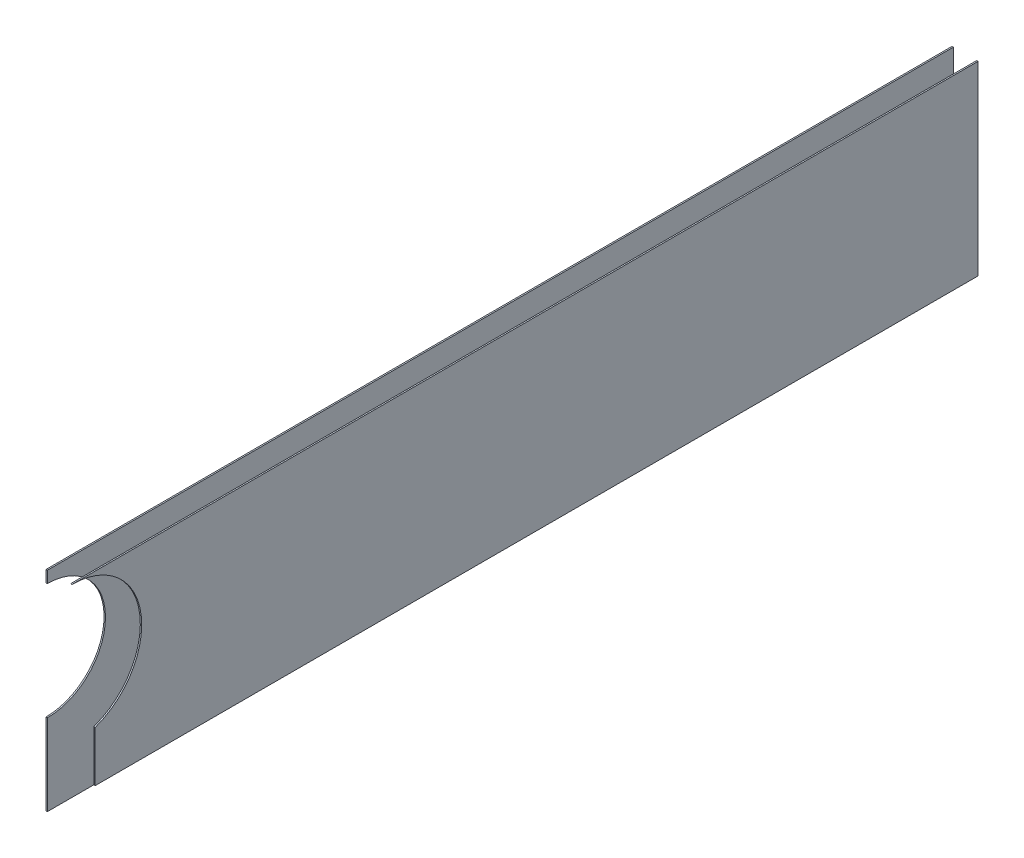
ISO-10303-21;
HEADER;
FILE_DESCRIPTION(('STEP AP214'),'2;1');
FILE_NAME('part.step','',(''),(''),'','','');
FILE_SCHEMA(('AUTOMOTIVE_DESIGN { 1 0 10303 214 1 1 1 1 }'));
ENDSEC;
DATA;
#1=APPLICATION_CONTEXT('core data for automotive mechanical design processes');
#2=APPLICATION_PROTOCOL_DEFINITION('international standard','automotive_design',2000,#1);
#3=PRODUCT_CONTEXT('',#1,'mechanical');
#4=PRODUCT('Part','Part','',(#3));
#5=PRODUCT_RELATED_PRODUCT_CATEGORY('part','',(#4));
#6=PRODUCT_DEFINITION_FORMATION('','',#4);
#7=PRODUCT_DEFINITION_CONTEXT('part definition',#1,'design');
#8=PRODUCT_DEFINITION('design','',#6,#7);
#9=PRODUCT_DEFINITION_SHAPE('','',#8);
#10=(LENGTH_UNIT() NAMED_UNIT(*) SI_UNIT(.MILLI.,.METRE.));
#11=(NAMED_UNIT(*) PLANE_ANGLE_UNIT() SI_UNIT($,.RADIAN.));
#12=(NAMED_UNIT(*) SI_UNIT($,.STERADIAN.) SOLID_ANGLE_UNIT());
#13=UNCERTAINTY_MEASURE_WITH_UNIT(LENGTH_MEASURE(1.E-05),#10,'distance_accuracy_value','');
#14=(GEOMETRIC_REPRESENTATION_CONTEXT(3) GLOBAL_UNCERTAINTY_ASSIGNED_CONTEXT((#13)) GLOBAL_UNIT_ASSIGNED_CONTEXT((#10,
#11,#12)) REPRESENTATION_CONTEXT('',''));
#15=CARTESIAN_POINT('',(0.,0.,0.));
#16=DIRECTION('',(0.,0.,1.));
#17=DIRECTION('',(1.,0.,0.));
#18=AXIS2_PLACEMENT_3D('',#15,#16,#17);
#19=CARTESIAN_POINT('',(-521.502987022629,700.,-237.681641947689));
#20=DIRECTION('',(0.,1.,0.));
#21=DIRECTION('',(0.,0.,-1.));
#22=AXIS2_PLACEMENT_3D('',#19,#20,#21);
#23=PLANE('',#22);
#24=DIRECTION('',(0.,0.,-1.));
#25=VECTOR('',#24,1.);
#26=CARTESIAN_POINT('',(-521.202987022629,700.,-237.681641947689));
#27=LINE('',#26,#25);
#28=CARTESIAN_POINT('',(-521.202987022629,700.,-237.681641947689));
#29=VERTEX_POINT('',#28);
#30=CARTESIAN_POINT('',(-521.202987022629,700.,-432.681641947689));
#31=VERTEX_POINT('',#30);
#32=EDGE_CURVE('E130',#29,#31,#27,.T.);
#33=ORIENTED_EDGE('',*,*,#32,.F.);
#34=DIRECTION('',(1.,0.,0.));
#35=VECTOR('',#34,1.);
#36=CARTESIAN_POINT('',(-521.502987022629,700.,-237.681641947689));
#37=LINE('',#36,#35);
#38=CARTESIAN_POINT('',(-521.502987022629,700.,-237.681641947689));
#39=VERTEX_POINT('',#38);
#40=EDGE_CURVE('E129',#39,#29,#37,.T.);
#41=ORIENTED_EDGE('',*,*,#40,.F.);
#42=DIRECTION('',(0.,0.,-1.));
#43=VECTOR('',#42,1.);
#44=CARTESIAN_POINT('',(-521.502987022629,700.,-237.681641947689));
#45=LINE('',#44,#43);
#46=CARTESIAN_POINT('',(-521.502987022629,700.,-432.681641947689));
#47=VERTEX_POINT('',#46);
#48=EDGE_CURVE('E142',#39,#47,#45,.T.);
#49=ORIENTED_EDGE('',*,*,#48,.T.);
#50=DIRECTION('',(1.,0.,0.));
#51=VECTOR('',#50,1.);
#52=CARTESIAN_POINT('',(-521.502987022629,700.,-432.681641947689));
#53=LINE('',#52,#51);
#54=EDGE_CURVE('E12',#47,#31,#53,.T.);
#55=ORIENTED_EDGE('',*,*,#54,.T.);
#56=EDGE_LOOP('',(#33,#41,#49,#55));
#57=FACE_BOUND('',#56,.T.);
#58=ADVANCED_FACE('F47',(#57),#23,.F.);
#59=CARTESIAN_POINT('',(-521.502987022629,700.,-432.681641947689));
#60=DIRECTION('',(0.,0.,1.));
#61=DIRECTION('',(-1.,0.,0.));
#62=AXIS2_PLACEMENT_3D('',#59,#60,#61);
#63=PLANE('',#62);
#64=DIRECTION('',(0.,1.,0.));
#65=VECTOR('',#64,1.);
#66=CARTESIAN_POINT('',(-521.202987022629,700.,-432.681641947689));
#67=LINE('',#66,#65);
#68=CARTESIAN_POINT('',(-521.202987022629,745.,-432.681641947689));
#69=VERTEX_POINT('',#68);
#70=EDGE_CURVE('E132',#31,#69,#67,.T.);
#71=ORIENTED_EDGE('',*,*,#70,.F.);
#72=ORIENTED_EDGE('',*,*,#54,.F.);
#73=DIRECTION('',(0.,1.,0.));
#74=VECTOR('',#73,1.);
#75=CARTESIAN_POINT('',(-521.502987022629,700.,-432.681641947689));
#76=LINE('',#75,#74);
#77=CARTESIAN_POINT('',(-521.502987022629,745.,-432.681641947689));
#78=VERTEX_POINT('',#77);
#79=EDGE_CURVE('E95',#47,#78,#76,.T.);
#80=ORIENTED_EDGE('',*,*,#79,.T.);
#81=DIRECTION('',(1.,0.,0.));
#82=VECTOR('',#81,1.);
#83=CARTESIAN_POINT('',(-521.502987022629,745.,-432.681641947689));
#84=LINE('',#83,#82);
#85=EDGE_CURVE('E55',#78,#69,#84,.T.);
#86=ORIENTED_EDGE('',*,*,#85,.T.);
#87=EDGE_LOOP('',(#71,#72,#80,#86));
#88=FACE_BOUND('',#87,.T.);
#89=ADVANCED_FACE('F148',(#88),#63,.F.);
#90=CARTESIAN_POINT('',(-521.502987022629,745.,-432.681641947689));
#91=DIRECTION('',(0.,-1.,0.));
#92=DIRECTION('',(0.,0.,1.));
#93=AXIS2_PLACEMENT_3D('',#90,#91,#92);
#94=PLANE('',#93);
#95=DIRECTION('',(0.,0.,1.));
#96=VECTOR('',#95,1.);
#97=CARTESIAN_POINT('',(-521.202987022629,745.,-432.681641947689));
#98=LINE('',#97,#96);
#99=CARTESIAN_POINT('',(-521.202987022629,745.,-237.681641947689));
#100=VERTEX_POINT('',#99);
#101=EDGE_CURVE('E135',#69,#100,#98,.T.);
#102=ORIENTED_EDGE('',*,*,#101,.F.);
#103=ORIENTED_EDGE('',*,*,#85,.F.);
#104=DIRECTION('',(0.,0.,1.));
#105=VECTOR('',#104,1.);
#106=CARTESIAN_POINT('',(-521.502987022629,745.,-432.681641947689));
#107=LINE('',#106,#105);
#108=CARTESIAN_POINT('',(-521.502987022629,745.,-237.681641947689));
#109=VERTEX_POINT('',#108);
#110=EDGE_CURVE('E123',#78,#109,#107,.T.);
#111=ORIENTED_EDGE('',*,*,#110,.T.);
#112=DIRECTION('',(1.,0.,0.));
#113=VECTOR('',#112,1.);
#114=CARTESIAN_POINT('',(-521.502987022629,745.,-237.681641947689));
#115=LINE('',#114,#113);
#116=EDGE_CURVE('E117',#109,#100,#115,.T.);
#117=ORIENTED_EDGE('',*,*,#116,.T.);
#118=EDGE_LOOP('',(#102,#103,#111,#117));
#119=FACE_BOUND('',#118,.T.);
#120=ADVANCED_FACE('F170',(#119),#94,.F.);
#121=CARTESIAN_POINT('',(-521.502987022629,745.,-237.681641947689));
#122=DIRECTION('',(0.,0.,-1.));
#123=DIRECTION('',(1.,0.,0.));
#124=AXIS2_PLACEMENT_3D('',#121,#122,#123);
#125=PLANE('',#124);
#126=DIRECTION('',(0.,-1.,0.));
#127=VECTOR('',#126,1.);
#128=CARTESIAN_POINT('',(-521.202987022629,745.,-237.681641947689));
#129=LINE('',#128,#127);
#130=CARTESIAN_POINT('',(-521.202987022629,742.5,-237.681641947689));
#131=VERTEX_POINT('',#130);
#132=EDGE_CURVE('E138',#100,#131,#129,.T.);
#133=ORIENTED_EDGE('',*,*,#132,.F.);
#134=ORIENTED_EDGE('',*,*,#116,.F.);
#135=DIRECTION('',(0.,-1.,0.));
#136=VECTOR('',#135,1.);
#137=CARTESIAN_POINT('',(-521.502987022629,745.,-237.681641947689));
#138=LINE('',#137,#136);
#139=CARTESIAN_POINT('',(-521.502987022629,742.5,-237.681641947689));
#140=VERTEX_POINT('',#139);
#141=EDGE_CURVE('E107',#109,#140,#138,.T.);
#142=ORIENTED_EDGE('',*,*,#141,.T.);
#143=DIRECTION('',(1.,0.,0.));
#144=VECTOR('',#143,1.);
#145=CARTESIAN_POINT('',(-521.502987022629,742.5,-237.681641947689));
#146=LINE('',#145,#144);
#147=EDGE_CURVE('E112',#140,#131,#146,.T.);
#148=ORIENTED_EDGE('',*,*,#147,.T.);
#149=EDGE_LOOP('',(#133,#134,#142,#148));
#150=FACE_BOUND('',#149,.T.);
#151=ADVANCED_FACE('F120',(#150),#125,.F.);
#152=CARTESIAN_POINT('',(-521.502987022629,730.,-237.681641947689));
#153=DIRECTION('',(1.,0.,0.));
#154=DIRECTION('',(0.,0.,1.));
#155=AXIS2_PLACEMENT_3D('',#152,#153,#154);
#156=CYLINDRICAL_SURFACE('',#155,12.5);
#157=CARTESIAN_POINT('',(-521.202987022629,730.,-237.681641947689));
#158=DIRECTION('',(-1.,0.,0.));
#159=DIRECTION('',(0.,0.,-1.));
#160=AXIS2_PLACEMENT_3D('',#157,#158,#159);
#161=CIRCLE('',#160,12.5);
#162=CARTESIAN_POINT('',(-521.202987022629,717.5,-237.681641947689));
#163=VERTEX_POINT('',#162);
#164=EDGE_CURVE('E114',#131,#163,#161,.T.);
#165=ORIENTED_EDGE('',*,*,#164,.F.);
#166=ORIENTED_EDGE('',*,*,#147,.F.);
#167=CARTESIAN_POINT('',(-521.502987022629,730.,-237.681641947689));
#168=DIRECTION('',(-1.,0.,0.));
#169=DIRECTION('',(0.,0.,-1.));
#170=AXIS2_PLACEMENT_3D('',#167,#168,#169);
#171=CIRCLE('',#170,12.5);
#172=CARTESIAN_POINT('',(-521.502987022629,717.5,-237.681641947689));
#173=VERTEX_POINT('',#172);
#174=EDGE_CURVE('E103',#140,#173,#171,.T.);
#175=ORIENTED_EDGE('',*,*,#174,.T.);
#176=DIRECTION('',(1.,0.,0.));
#177=VECTOR('',#176,1.);
#178=CARTESIAN_POINT('',(-521.502987022629,717.5,-237.681641947689));
#179=LINE('',#178,#177);
#180=EDGE_CURVE('E118',#173,#163,#179,.T.);
#181=ORIENTED_EDGE('',*,*,#180,.T.);
#182=EDGE_LOOP('',(#165,#166,#175,#181));
#183=FACE_BOUND('',#182,.T.);
#184=ADVANCED_FACE('F113',(#183),#156,.F.);
#185=CARTESIAN_POINT('',(-521.502987022629,717.5,-237.681641947689));
#186=DIRECTION('',(0.,0.,-1.));
#187=DIRECTION('',(1.,0.,0.));
#188=AXIS2_PLACEMENT_3D('',#185,#186,#187);
#189=PLANE('',#188);
#190=DIRECTION('',(0.,-1.,0.));
#191=VECTOR('',#190,1.);
#192=CARTESIAN_POINT('',(-521.202987022629,717.5,-237.681641947689));
#193=LINE('',#192,#191);
#194=EDGE_CURVE('E83',#163,#29,#193,.T.);
#195=ORIENTED_EDGE('',*,*,#194,.F.);
#196=ORIENTED_EDGE('',*,*,#180,.F.);
#197=DIRECTION('',(0.,-1.,0.));
#198=VECTOR('',#197,1.);
#199=CARTESIAN_POINT('',(-521.502987022629,717.5,-237.681641947689));
#200=LINE('',#199,#198);
#201=EDGE_CURVE('E63',#173,#39,#200,.T.);
#202=ORIENTED_EDGE('',*,*,#201,.T.);
#203=ORIENTED_EDGE('',*,*,#40,.T.);
#204=EDGE_LOOP('',(#195,#196,#202,#203));
#205=FACE_BOUND('',#204,.T.);
#206=ADVANCED_FACE('F156',(#205),#189,.F.);
#207=CARTESIAN_POINT('',(-521.502987022629,730.,-237.681641947689));
#208=DIRECTION('',(-1.,0.,0.));
#209=DIRECTION('',(0.,0.,-1.));
#210=AXIS2_PLACEMENT_3D('',#207,#208,#209);
#211=PLANE('',#210);
#212=ORIENTED_EDGE('',*,*,#48,.F.);
#213=ORIENTED_EDGE('',*,*,#201,.F.);
#214=ORIENTED_EDGE('',*,*,#174,.F.);
#215=ORIENTED_EDGE('',*,*,#141,.F.);
#216=ORIENTED_EDGE('',*,*,#110,.F.);
#217=ORIENTED_EDGE('',*,*,#79,.F.);
#218=EDGE_LOOP('',(#212,#213,#214,#215,#216,#217));
#219=FACE_BOUND('',#218,.T.);
#220=ADVANCED_FACE('F105',(#219),#211,.T.);
#221=CARTESIAN_POINT('',(-521.202987022629,730.,-237.681641947689));
#222=DIRECTION('',(-1.,0.,0.));
#223=DIRECTION('',(0.,0.,-1.));
#224=AXIS2_PLACEMENT_3D('',#221,#222,#223);
#225=PLANE('',#224);
#226=ORIENTED_EDGE('',*,*,#32,.T.);
#227=ORIENTED_EDGE('',*,*,#70,.T.);
#228=ORIENTED_EDGE('',*,*,#101,.T.);
#229=ORIENTED_EDGE('',*,*,#132,.T.);
#230=ORIENTED_EDGE('',*,*,#164,.T.);
#231=ORIENTED_EDGE('',*,*,#194,.T.);
#232=EDGE_LOOP('',(#226,#227,#228,#229,#230,#231));
#233=FACE_BOUND('',#232,.T.);
#234=ADVANCED_FACE('F150',(#233),#225,.F.);
#235=CLOSED_SHELL('',(#58,#89,#120,#151,#184,#206,#220,#234));
#236=MANIFOLD_SOLID_BREP('B2',#235);
#237=CARTESIAN_POINT('',(-515.90298702263,745.,-432.681641947689));
#238=DIRECTION('',(0.,0.,1.));
#239=DIRECTION('',(-1.,0.,0.));
#240=AXIS2_PLACEMENT_3D('',#237,#238,#239);
#241=PLANE('',#240);
#242=DIRECTION('',(0.,-1.,0.));
#243=VECTOR('',#242,1.);
#244=CARTESIAN_POINT('',(-516.202987022629,745.,-432.681641947689));
#245=LINE('',#244,#243);
#246=CARTESIAN_POINT('',(-516.202987022629,745.,-432.681641947689));
#247=VERTEX_POINT('',#246);
#248=CARTESIAN_POINT('',(-516.202987022629,705.,-432.681641947689));
#249=VERTEX_POINT('',#248);
#250=EDGE_CURVE('E298',#247,#249,#245,.T.);
#251=ORIENTED_EDGE('',*,*,#250,.F.);
#252=DIRECTION('',(-1.,0.,0.));
#253=VECTOR('',#252,1.);
#254=CARTESIAN_POINT('',(-515.90298702263,745.,-432.681641947689));
#255=LINE('',#254,#253);
#256=CARTESIAN_POINT('',(-515.90298702263,745.,-432.681641947689));
#257=VERTEX_POINT('',#256);
#258=EDGE_CURVE('E297',#257,#247,#255,.T.);
#259=ORIENTED_EDGE('',*,*,#258,.F.);
#260=DIRECTION('',(0.,-1.,0.));
#261=VECTOR('',#260,1.);
#262=CARTESIAN_POINT('',(-515.90298702263,745.,-432.681641947689));
#263=LINE('',#262,#261);
#264=CARTESIAN_POINT('',(-515.90298702263,705.,-432.681641947689));
#265=VERTEX_POINT('',#264);
#266=EDGE_CURVE('E292',#257,#265,#263,.T.);
#267=ORIENTED_EDGE('',*,*,#266,.T.);
#268=DIRECTION('',(-1.,0.,0.));
#269=VECTOR('',#268,1.);
#270=CARTESIAN_POINT('',(-515.90298702263,705.,-432.681641947689));
#271=LINE('',#270,#269);
#272=EDGE_CURVE('E45',#265,#249,#271,.T.);
#273=ORIENTED_EDGE('',*,*,#272,.T.);
#274=EDGE_LOOP('',(#251,#259,#267,#273));
#275=FACE_BOUND('',#274,.T.);
#276=ADVANCED_FACE('F223',(#275),#241,.F.);
#277=CARTESIAN_POINT('',(-515.90298702263,705.,-432.681641947689));
#278=DIRECTION('',(0.,1.,0.));
#279=DIRECTION('',(0.,0.,-1.));
#280=AXIS2_PLACEMENT_3D('',#277,#278,#279);
#281=PLANE('',#280);
#282=DIRECTION('',(0.,0.,1.));
#283=VECTOR('',#282,1.);
#284=CARTESIAN_POINT('',(-516.202987022629,705.,-432.681641947689));
#285=LINE('',#284,#283);
#286=CARTESIAN_POINT('',(-516.202987022629,705.,-242.681641947689));
#287=VERTEX_POINT('',#286);
#288=EDGE_CURVE('E300',#249,#287,#285,.T.);
#289=ORIENTED_EDGE('',*,*,#288,.F.);
#290=ORIENTED_EDGE('',*,*,#272,.F.);
#291=DIRECTION('',(0.,0.,1.));
#292=VECTOR('',#291,1.);
#293=CARTESIAN_POINT('',(-515.90298702263,705.,-432.681641947689));
#294=LINE('',#293,#292);
#295=CARTESIAN_POINT('',(-515.90298702263,705.,-242.681641947689));
#296=VERTEX_POINT('',#295);
#297=EDGE_CURVE('E268',#265,#296,#294,.T.);
#298=ORIENTED_EDGE('',*,*,#297,.T.);
#299=DIRECTION('',(-1.,0.,0.));
#300=VECTOR('',#299,1.);
#301=CARTESIAN_POINT('',(-515.90298702263,705.,-242.681641947689));
#302=LINE('',#301,#300);
#303=EDGE_CURVE('E231',#296,#287,#302,.T.);
#304=ORIENTED_EDGE('',*,*,#303,.T.);
#305=EDGE_LOOP('',(#289,#290,#298,#304));
#306=FACE_BOUND('',#305,.T.);
#307=ADVANCED_FACE('F309',(#306),#281,.F.);
#308=CARTESIAN_POINT('',(-515.90298702263,705.,-242.681641947689));
#309=DIRECTION('',(0.,0.,-1.));
#310=DIRECTION('',(0.,-1.,0.));
#311=AXIS2_PLACEMENT_3D('',#308,#309,#310);
#312=PLANE('',#311);
#313=DIRECTION('',(0.,1.,0.));
#314=VECTOR('',#313,1.);
#315=CARTESIAN_POINT('',(-516.202987022629,705.,-242.681641947689));
#316=LINE('',#315,#314);
#317=CARTESIAN_POINT('',(-516.202987022629,715.857864376269,-242.681641947689));
#318=VERTEX_POINT('',#317);
#319=EDGE_CURVE('E303',#287,#318,#316,.T.);
#320=ORIENTED_EDGE('',*,*,#319,.F.);
#321=ORIENTED_EDGE('',*,*,#303,.F.);
#322=DIRECTION('',(0.,1.,0.));
#323=VECTOR('',#322,1.);
#324=CARTESIAN_POINT('',(-515.90298702263,705.,-242.681641947689));
#325=LINE('',#324,#323);
#326=CARTESIAN_POINT('',(-515.90298702263,715.857864376269,-242.681641947689));
#327=VERTEX_POINT('',#326);
#328=EDGE_CURVE('E277',#296,#327,#325,.T.);
#329=ORIENTED_EDGE('',*,*,#328,.T.);
#330=DIRECTION('',(-1.,0.,0.));
#331=VECTOR('',#330,1.);
#332=CARTESIAN_POINT('',(-515.90298702263,715.857864376269,-242.681641947689));
#333=LINE('',#332,#331);
#334=EDGE_CURVE('E282',#327,#318,#333,.T.);
#335=ORIENTED_EDGE('',*,*,#334,.T.);
#336=EDGE_LOOP('',(#320,#321,#329,#335));
#337=FACE_BOUND('',#336,.T.);
#338=ADVANCED_FACE('F289',(#337),#312,.F.);
#339=CARTESIAN_POINT('',(-515.90298702263,730.,-237.681641947689));
#340=DIRECTION('',(-1.,0.,0.));
#341=DIRECTION('',(0.,0.,-1.));
#342=AXIS2_PLACEMENT_3D('',#339,#340,#341);
#343=CYLINDRICAL_SURFACE('',#342,15.);
#344=CARTESIAN_POINT('',(-516.202987022629,730.,-237.681641947689));
#345=DIRECTION('',(1.,0.,0.));
#346=DIRECTION('',(0.,0.,1.));
#347=AXIS2_PLACEMENT_3D('',#344,#345,#346);
#348=CIRCLE('',#347,15.);
#349=CARTESIAN_POINT('',(-516.202987022629,745.,-237.681641947689));
#350=VERTEX_POINT('',#349);
#351=EDGE_CURVE('E284',#318,#350,#348,.T.);
#352=ORIENTED_EDGE('',*,*,#351,.F.);
#353=ORIENTED_EDGE('',*,*,#334,.F.);
#354=CARTESIAN_POINT('',(-515.90298702263,730.,-237.681641947689));
#355=DIRECTION('',(1.,0.,0.));
#356=DIRECTION('',(0.,0.,1.));
#357=AXIS2_PLACEMENT_3D('',#354,#355,#356);
#358=CIRCLE('',#357,15.);
#359=CARTESIAN_POINT('',(-515.90298702263,745.,-237.681641947689));
#360=VERTEX_POINT('',#359);
#361=EDGE_CURVE('E273',#327,#360,#358,.T.);
#362=ORIENTED_EDGE('',*,*,#361,.T.);
#363=DIRECTION('',(-1.,0.,0.));
#364=VECTOR('',#363,1.);
#365=CARTESIAN_POINT('',(-515.90298702263,745.,-237.681641947689));
#366=LINE('',#365,#364);
#367=EDGE_CURVE('E287',#360,#350,#366,.T.);
#368=ORIENTED_EDGE('',*,*,#367,.T.);
#369=EDGE_LOOP('',(#352,#353,#362,#368));
#370=FACE_BOUND('',#369,.T.);
#371=ADVANCED_FACE('F283',(#370),#343,.F.);
#372=CARTESIAN_POINT('',(-515.90298702263,745.,-237.681641947689));
#373=DIRECTION('',(0.,-1.,0.));
#374=DIRECTION('',(0.,0.,1.));
#375=AXIS2_PLACEMENT_3D('',#372,#373,#374);
#376=PLANE('',#375);
#377=DIRECTION('',(0.,0.,-1.));
#378=VECTOR('',#377,1.);
#379=CARTESIAN_POINT('',(-516.202987022629,745.,-237.681641947689));
#380=LINE('',#379,#378);
#381=EDGE_CURVE('E256',#350,#247,#380,.T.);
#382=ORIENTED_EDGE('',*,*,#381,.F.);
#383=ORIENTED_EDGE('',*,*,#367,.F.);
#384=DIRECTION('',(0.,0.,-1.));
#385=VECTOR('',#384,1.);
#386=CARTESIAN_POINT('',(-515.90298702263,745.,-237.681641947689));
#387=LINE('',#386,#385);
#388=EDGE_CURVE('E239',#360,#257,#387,.T.);
#389=ORIENTED_EDGE('',*,*,#388,.T.);
#390=ORIENTED_EDGE('',*,*,#258,.T.);
#391=EDGE_LOOP('',(#382,#383,#389,#390));
#392=FACE_BOUND('',#391,.T.);
#393=ADVANCED_FACE('F315',(#392),#376,.F.);
#394=CARTESIAN_POINT('',(-515.90298702263,730.,-237.681641947689));
#395=DIRECTION('',(1.,0.,0.));
#396=DIRECTION('',(0.,0.,1.));
#397=AXIS2_PLACEMENT_3D('',#394,#395,#396);
#398=PLANE('',#397);
#399=ORIENTED_EDGE('',*,*,#266,.F.);
#400=ORIENTED_EDGE('',*,*,#388,.F.);
#401=ORIENTED_EDGE('',*,*,#361,.F.);
#402=ORIENTED_EDGE('',*,*,#328,.F.);
#403=ORIENTED_EDGE('',*,*,#297,.F.);
#404=EDGE_LOOP('',(#399,#400,#401,#402,#403));
#405=FACE_BOUND('',#404,.T.);
#406=ADVANCED_FACE('F275',(#405),#398,.T.);
#407=CARTESIAN_POINT('',(-516.202987022629,730.,-237.681641947689));
#408=DIRECTION('',(1.,0.,0.));
#409=DIRECTION('',(0.,0.,1.));
#410=AXIS2_PLACEMENT_3D('',#407,#408,#409);
#411=PLANE('',#410);
#412=ORIENTED_EDGE('',*,*,#250,.T.);
#413=ORIENTED_EDGE('',*,*,#288,.T.);
#414=ORIENTED_EDGE('',*,*,#319,.T.);
#415=ORIENTED_EDGE('',*,*,#351,.T.);
#416=ORIENTED_EDGE('',*,*,#381,.T.);
#417=EDGE_LOOP('',(#412,#413,#414,#415,#416));
#418=FACE_BOUND('',#417,.T.);
#419=ADVANCED_FACE('F310',(#418),#411,.F.);
#420=CLOSED_SHELL('',(#276,#307,#338,#371,#393,#406,#419));
#421=MANIFOLD_SOLID_BREP('B6',#420);
#422=ADVANCED_BREP_SHAPE_REPRESENTATION('',(#18,#236,#421),#14);
#423=SHAPE_DEFINITION_REPRESENTATION(#9,#422);
ENDSEC;
END-ISO-10303-21;
